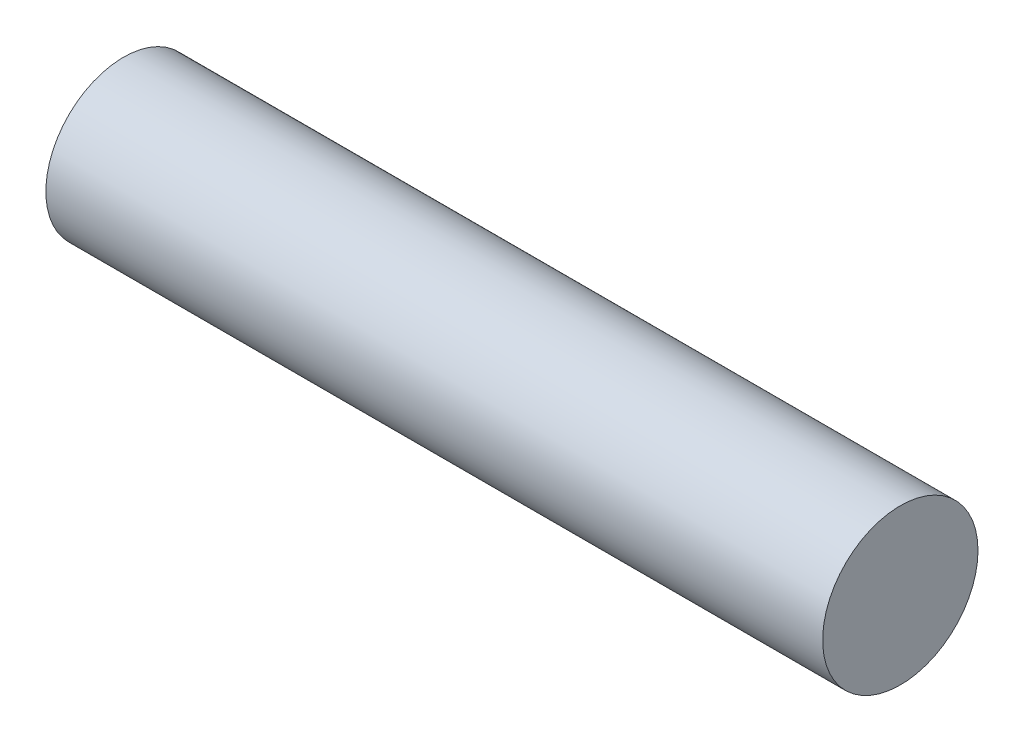
ISO-10303-21;
HEADER;
FILE_DESCRIPTION(('STEP AP214'),'2;1');
FILE_NAME('part.step','',(''),(''),'','','');
FILE_SCHEMA(('AUTOMOTIVE_DESIGN { 1 0 10303 214 1 1 1 1 }'));
ENDSEC;
DATA;
#1=APPLICATION_CONTEXT('core data for automotive mechanical design processes');
#2=APPLICATION_PROTOCOL_DEFINITION('international standard','automotive_design',2000,#1);
#3=PRODUCT_CONTEXT('',#1,'mechanical');
#4=PRODUCT('Part','Part','',(#3));
#5=PRODUCT_RELATED_PRODUCT_CATEGORY('part','',(#4));
#6=PRODUCT_DEFINITION_FORMATION('','',#4);
#7=PRODUCT_DEFINITION_CONTEXT('part definition',#1,'design');
#8=PRODUCT_DEFINITION('design','',#6,#7);
#9=PRODUCT_DEFINITION_SHAPE('','',#8);
#10=(LENGTH_UNIT() NAMED_UNIT(*) SI_UNIT(.MILLI.,.METRE.));
#11=(NAMED_UNIT(*) PLANE_ANGLE_UNIT() SI_UNIT($,.RADIAN.));
#12=(NAMED_UNIT(*) SI_UNIT($,.STERADIAN.) SOLID_ANGLE_UNIT());
#13=UNCERTAINTY_MEASURE_WITH_UNIT(LENGTH_MEASURE(1.E-05),#10,'distance_accuracy_value','');
#14=(GEOMETRIC_REPRESENTATION_CONTEXT(3) GLOBAL_UNCERTAINTY_ASSIGNED_CONTEXT((#13)) GLOBAL_UNIT_ASSIGNED_CONTEXT((#10,
#11,#12)) REPRESENTATION_CONTEXT('',''));
#15=CARTESIAN_POINT('',(0.,0.,0.));
#16=DIRECTION('',(0.,0.,1.));
#17=DIRECTION('',(1.,0.,0.));
#18=AXIS2_PLACEMENT_3D('',#15,#16,#17);
#19=CARTESIAN_POINT('',(400.,0.,0.));
#20=DIRECTION('',(-1.,0.,0.));
#21=DIRECTION('',(0.,0.,1.));
#22=AXIS2_PLACEMENT_3D('',#19,#20,#21);
#23=CYLINDRICAL_SURFACE('',#22,40.);
#24=CARTESIAN_POINT('',(400.,0.,0.));
#25=DIRECTION('',(1.,0.,0.));
#26=DIRECTION('',(0.,0.,-1.));
#27=AXIS2_PLACEMENT_3D('',#24,#25,#26);
#28=CIRCLE('',#27,40.);
#29=CARTESIAN_POINT('',(400.,0.,-40.));
#30=VERTEX_POINT('',#29);
#31=EDGE_CURVE('E10',#30,#30,#28,.T.);
#32=ORIENTED_EDGE('',*,*,#31,.F.);
#33=EDGE_LOOP('',(#32));
#34=FACE_BOUND('',#33,.T.);
#35=CARTESIAN_POINT('',(0.,0.,0.));
#36=DIRECTION('',(1.,0.,0.));
#37=DIRECTION('',(0.,0.,-1.));
#38=AXIS2_PLACEMENT_3D('',#35,#36,#37);
#39=CIRCLE('',#38,40.);
#40=CARTESIAN_POINT('',(0.,0.,-40.));
#41=VERTEX_POINT('',#40);
#42=EDGE_CURVE('E40',#41,#41,#39,.T.);
#43=ORIENTED_EDGE('',*,*,#42,.T.);
#44=EDGE_LOOP('',(#43));
#45=FACE_BOUND('',#44,.T.);
#46=ADVANCED_FACE('F37',(#34,#45),#23,.T.);
#47=CARTESIAN_POINT('',(400.,0.,0.));
#48=DIRECTION('',(1.,0.,0.));
#49=DIRECTION('',(0.,0.,-1.));
#50=AXIS2_PLACEMENT_3D('',#47,#48,#49);
#51=PLANE('',#50);
#52=ORIENTED_EDGE('',*,*,#31,.T.);
#53=EDGE_LOOP('',(#52));
#54=FACE_BOUND('',#53,.T.);
#55=ADVANCED_FACE('F52',(#54),#51,.T.);
#56=CARTESIAN_POINT('',(0.,0.,0.));
#57=DIRECTION('',(1.,0.,0.));
#58=DIRECTION('',(0.,0.,-1.));
#59=AXIS2_PLACEMENT_3D('',#56,#57,#58);
#60=PLANE('',#59);
#61=ORIENTED_EDGE('',*,*,#42,.F.);
#62=EDGE_LOOP('',(#61));
#63=FACE_BOUND('',#62,.T.);
#64=ADVANCED_FACE('F50',(#63),#60,.F.);
#65=CLOSED_SHELL('',(#46,#55,#64));
#66=MANIFOLD_SOLID_BREP('B2',#65);
#67=ADVANCED_BREP_SHAPE_REPRESENTATION('',(#18,#66),#14);
#68=SHAPE_DEFINITION_REPRESENTATION(#9,#67);
ENDSEC;
END-ISO-10303-21;
